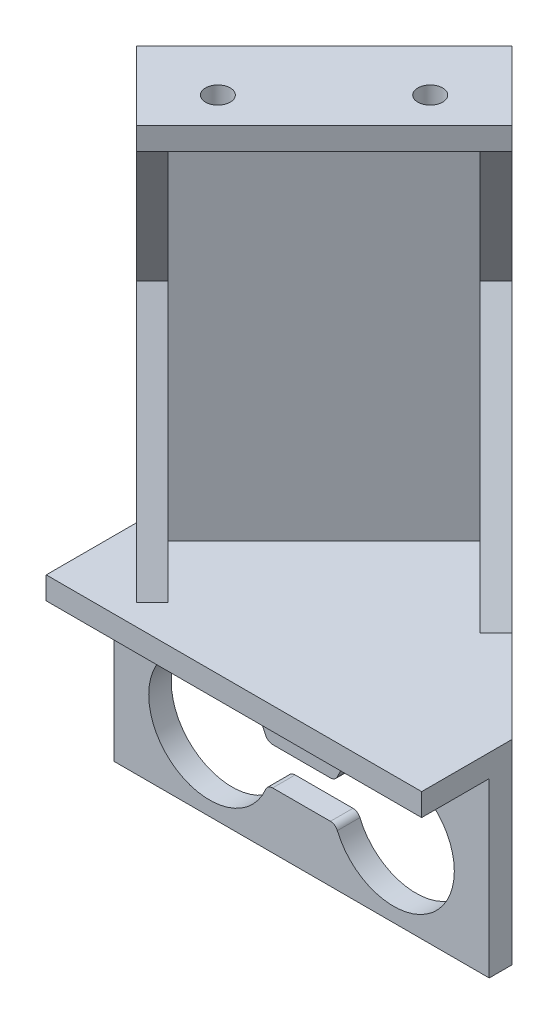
ISO-10303-21;
HEADER;
FILE_DESCRIPTION(('STEP AP214'),'2;1');
FILE_NAME('part.step','',(''),(''),'','','');
FILE_SCHEMA(('AUTOMOTIVE_DESIGN { 1 0 10303 214 1 1 1 1 }'));
ENDSEC;
DATA;
#1=APPLICATION_CONTEXT('core data for automotive mechanical design processes');
#2=APPLICATION_PROTOCOL_DEFINITION('international standard','automotive_design',2000,#1);
#3=PRODUCT_CONTEXT('',#1,'mechanical');
#4=PRODUCT('Part','Part','',(#3));
#5=PRODUCT_RELATED_PRODUCT_CATEGORY('part','',(#4));
#6=PRODUCT_DEFINITION_FORMATION('','',#4);
#7=PRODUCT_DEFINITION_CONTEXT('part definition',#1,'design');
#8=PRODUCT_DEFINITION('design','',#6,#7);
#9=PRODUCT_DEFINITION_SHAPE('','',#8);
#10=(LENGTH_UNIT() NAMED_UNIT(*) SI_UNIT(.MILLI.,.METRE.));
#11=(NAMED_UNIT(*) PLANE_ANGLE_UNIT() SI_UNIT($,.RADIAN.));
#12=(NAMED_UNIT(*) SI_UNIT($,.STERADIAN.) SOLID_ANGLE_UNIT());
#13=UNCERTAINTY_MEASURE_WITH_UNIT(LENGTH_MEASURE(1.E-05),#10,'distance_accuracy_value','');
#14=(GEOMETRIC_REPRESENTATION_CONTEXT(3) GLOBAL_UNCERTAINTY_ASSIGNED_CONTEXT((#13)) GLOBAL_UNIT_ASSIGNED_CONTEXT((#10,
#11,#12)) REPRESENTATION_CONTEXT('',''));
#15=CARTESIAN_POINT('',(0.,0.,0.));
#16=DIRECTION('',(0.,0.,1.));
#17=DIRECTION('',(1.,0.,0.));
#18=AXIS2_PLACEMENT_3D('',#15,#16,#17);
#19=CARTESIAN_POINT('',(2.12132034355976,71.,-22.8786796564402));
#20=DIRECTION('',(0.707106781186548,0.,0.707106781186547));
#21=DIRECTION('',(0.707106781186547,0.,-0.707106781186548));
#22=AXIS2_PLACEMENT_3D('',#19,#20,#21);
#23=PLANE('',#22);
#24=DIRECTION('',(0.707106781186547,0.,-0.707106781186548));
#25=VECTOR('',#24,1.);
#26=CARTESIAN_POINT('',(1.23165366794353E-13,68.,-20.7573593128806));
#27=LINE('',#26,#25);
#28=CARTESIAN_POINT('',(-20.7573593128806,68.,1.30537941567255E-13));
#29=VERTEX_POINT('',#28);
#30=CARTESIAN_POINT('',(1.22506171873482E-13,68.,-20.7573593128806));
#31=VERTEX_POINT('',#30);
#32=EDGE_CURVE('E301',#29,#31,#27,.T.);
#33=ORIENTED_EDGE('',*,*,#32,.F.);
#34=DIRECTION('',(0.,1.,0.));
#35=VECTOR('',#34,1.);
#36=CARTESIAN_POINT('',(-20.7573593128806,0.,1.22731685925359E-13));
#37=LINE('',#36,#35);
#38=CARTESIAN_POINT('',(-20.7573593128806,46.,1.24032728532342E-13));
#39=VERTEX_POINT('',#38);
#40=EDGE_CURVE('E572',#39,#29,#37,.T.);
#41=ORIENTED_EDGE('',*,*,#40,.F.);
#42=DIRECTION('',(0.,1.,0.));
#43=VECTOR('',#42,1.);
#44=CARTESIAN_POINT('',(-20.7573593128806,0.,1.22731685925359E-13));
#45=LINE('',#44,#43);
#46=CARTESIAN_POINT('',(-20.7573593128806,16.,1.27502175484295E-13));
#47=VERTEX_POINT('',#46);
#48=EDGE_CURVE('E562',#47,#39,#45,.T.);
#49=ORIENTED_EDGE('',*,*,#48,.F.);
#50=DIRECTION('',(-0.707106781186547,0.,0.707106781186548));
#51=VECTOR('',#50,1.);
#52=CARTESIAN_POINT('',(2.12132034355977,16.,-22.8786796564402));
#53=LINE('',#52,#51);
#54=CARTESIAN_POINT('',(0.,16.,-20.7573593128805));
#55=VERTEX_POINT('',#54);
#56=EDGE_CURVE('E309',#55,#47,#53,.T.);
#57=ORIENTED_EDGE('',*,*,#56,.F.);
#58=DIRECTION('',(0.,-1.,0.));
#59=VECTOR('',#58,1.);
#60=CARTESIAN_POINT('',(0.,0.,-20.7573593128805));
#61=LINE('',#60,#59);
#62=CARTESIAN_POINT('',(0.,46.,-20.7573593128805));
#63=VERTEX_POINT('',#62);
#64=EDGE_CURVE('E520',#63,#55,#61,.T.);
#65=ORIENTED_EDGE('',*,*,#64,.F.);
#66=DIRECTION('',(0.,-1.,0.));
#67=VECTOR('',#66,1.);
#68=CARTESIAN_POINT('',(0.,0.,-20.7573593128805));
#69=LINE('',#68,#67);
#70=EDGE_CURVE('E518',#31,#63,#69,.T.);
#71=ORIENTED_EDGE('',*,*,#70,.F.);
#72=EDGE_LOOP('',(#33,#41,#49,#57,#65,#71));
#73=FACE_BOUND('',#72,.T.);
#74=ADVANCED_FACE('F78',(#73),#23,.T.);
#75=CARTESIAN_POINT('',(7.0710678118656,68.,-13.6862915010151));
#76=DIRECTION('',(0.,1.,0.));
#77=DIRECTION('',(-1.,0.,0.));
#78=AXIS2_PLACEMENT_3D('',#75,#76,#77);
#79=PLANE('',#78);
#80=CARTESIAN_POINT('',(0.227922061357971,68.,-13.914213562373));
#81=DIRECTION('',(0.,-1.,0.));
#82=DIRECTION('',(0.,0.,-1.));
#83=AXIS2_PLACEMENT_3D('',#80,#81,#82);
#84=CIRCLE('',#83,1.65);
#85=CARTESIAN_POINT('',(0.227922061357971,68.,-15.564213562373));
#86=VERTEX_POINT('',#85);
#87=EDGE_CURVE('E591',#86,#86,#84,.T.);
#88=ORIENTED_EDGE('',*,*,#87,.F.);
#89=EDGE_LOOP('',(#88));
#90=FACE_BOUND('',#89,.T.);
#91=CARTESIAN_POINT('',(-13.914213562373,68.,0.227922061357981));
#92=DIRECTION('',(0.,-1.,0.));
#93=DIRECTION('',(0.,0.,-1.));
#94=AXIS2_PLACEMENT_3D('',#91,#92,#93);
#95=CIRCLE('',#94,1.65);
#96=CARTESIAN_POINT('',(-13.914213562373,68.,-1.42207793864202));
#97=VERTEX_POINT('',#96);
#98=EDGE_CURVE('E585',#97,#97,#95,.T.);
#99=ORIENTED_EDGE('',*,*,#98,.F.);
#100=EDGE_LOOP('',(#99));
#101=FACE_BOUND('',#100,.T.);
#102=DIRECTION('',(0.707106781186549,0.,0.707106781186547));
#103=VECTOR('',#102,1.);
#104=CARTESIAN_POINT('',(-10.3786796564403,68.,10.3786796564404));
#105=LINE('',#104,#103);
#106=CARTESIAN_POINT('',(-13.6862915010151,68.,7.0710678118656));
#107=VERTEX_POINT('',#106);
#108=EDGE_CURVE('E294',#29,#107,#105,.T.);
#109=ORIENTED_EDGE('',*,*,#108,.F.);
#110=ORIENTED_EDGE('',*,*,#32,.T.);
#111=DIRECTION('',(-0.707106781186548,0.,-0.707106781186547));
#112=VECTOR('',#111,1.);
#113=CARTESIAN_POINT('',(7.0710678118656,68.,-13.6862915010151));
#114=LINE('',#113,#112);
#115=CARTESIAN_POINT('',(7.0710678118656,68.,-13.6862915010151));
#116=VERTEX_POINT('',#115);
#117=EDGE_CURVE('E284',#116,#31,#114,.T.);
#118=ORIENTED_EDGE('',*,*,#117,.F.);
#119=DIRECTION('',(0.707106781186547,0.,-0.707106781186548));
#120=VECTOR('',#119,1.);
#121=CARTESIAN_POINT('',(7.0710678118656,68.,-13.6862915010151));
#122=LINE('',#121,#120);
#123=EDGE_CURVE('E285',#107,#116,#122,.T.);
#124=ORIENTED_EDGE('',*,*,#123,.F.);
#125=EDGE_LOOP('',(#109,#110,#118,#124));
#126=FACE_BOUND('',#125,.T.);
#127=ADVANCED_FACE('F606',(#90,#101,#126),#79,.F.);
#128=CARTESIAN_POINT('',(0.,16.,0.));
#129=DIRECTION('',(0.,1.,0.));
#130=DIRECTION('',(-1.,0.,0.));
#131=AXIS2_PLACEMENT_3D('',#128,#129,#130);
#132=PLANE('',#131);
#133=ORIENTED_EDGE('',*,*,#56,.T.);
#134=DIRECTION('',(0.707106781186549,0.,0.707106781186547));
#135=VECTOR('',#134,1.);
#136=CARTESIAN_POINT('',(-10.3786796564403,16.,10.3786796564404));
#137=LINE('',#136,#135);
#138=CARTESIAN_POINT('',(-13.6862915010151,16.,7.0710678118656));
#139=VERTEX_POINT('',#138);
#140=EDGE_CURVE('E93',#47,#139,#137,.T.);
#141=ORIENTED_EDGE('',*,*,#140,.T.);
#142=DIRECTION('',(-0.707106781186546,0.,0.707106781186548));
#143=VECTOR('',#142,1.);
#144=CARTESIAN_POINT('',(-13.6862915010151,16.,7.07106781186559));
#145=LINE('',#144,#143);
#146=CARTESIAN_POINT('',(-15.8076118445747,16.,9.19238815542524));
#147=VERTEX_POINT('',#146);
#148=EDGE_CURVE('E575',#139,#147,#145,.T.);
#149=ORIENTED_EDGE('',*,*,#148,.T.);
#150=DIRECTION('',(0.707106781186549,0.,0.707106781186546));
#151=VECTOR('',#150,1.);
#152=CARTESIAN_POINT('',(-25.,16.,0.));
#153=LINE('',#152,#151);
#154=CARTESIAN_POINT('',(-25.,16.,0.));
#155=VERTEX_POINT('',#154);
#156=EDGE_CURVE('E101',#155,#147,#153,.T.);
#157=ORIENTED_EDGE('',*,*,#156,.F.);
#158=DIRECTION('',(0.,0.,1.));
#159=VECTOR('',#158,1.);
#160=CARTESIAN_POINT('',(-25.,16.,0.));
#161=LINE('',#160,#159);
#162=CARTESIAN_POINT('',(-25.,16.,12.));
#163=VERTEX_POINT('',#162);
#164=EDGE_CURVE('E346',#155,#163,#161,.T.);
#165=ORIENTED_EDGE('',*,*,#164,.T.);
#166=DIRECTION('',(1.,0.,0.));
#167=VECTOR('',#166,1.);
#168=CARTESIAN_POINT('',(-25.,16.,12.));
#169=LINE('',#168,#167);
#170=CARTESIAN_POINT('',(25.,16.,12.));
#171=VERTEX_POINT('',#170);
#172=EDGE_CURVE('E349',#163,#171,#169,.T.);
#173=ORIENTED_EDGE('',*,*,#172,.T.);
#174=DIRECTION('',(0.,0.,-1.));
#175=VECTOR('',#174,1.);
#176=CARTESIAN_POINT('',(25.,16.,0.));
#177=LINE('',#176,#175);
#178=CARTESIAN_POINT('',(25.,16.,0.));
#179=VERTEX_POINT('',#178);
#180=EDGE_CURVE('E351',#171,#179,#177,.T.);
#181=ORIENTED_EDGE('',*,*,#180,.T.);
#182=DIRECTION('',(-0.707106781186551,0.,-0.707106781186544));
#183=VECTOR('',#182,1.);
#184=CARTESIAN_POINT('',(25.,16.,0.));
#185=LINE('',#184,#183);
#186=CARTESIAN_POINT('',(12.7279220613579,16.,-12.272077938642));
#187=VERTEX_POINT('',#186);
#188=EDGE_CURVE('E320',#179,#187,#185,.T.);
#189=ORIENTED_EDGE('',*,*,#188,.T.);
#190=DIRECTION('',(0.707106781186544,0.,-0.707106781186551));
#191=VECTOR('',#190,1.);
#192=CARTESIAN_POINT('',(10.6066017177983,16.,-10.1507575950823));
#193=LINE('',#192,#191);
#194=CARTESIAN_POINT('',(10.6066017177983,16.,-10.1507575950823));
#195=VERTEX_POINT('',#194);
#196=EDGE_CURVE('E306',#195,#187,#193,.T.);
#197=ORIENTED_EDGE('',*,*,#196,.F.);
#198=DIRECTION('',(0.707106781186551,0.,0.707106781186544));
#199=VECTOR('',#198,1.);
#200=CARTESIAN_POINT('',(10.3786796564402,16.,-10.3786796564403));
#201=LINE('',#200,#199);
#202=EDGE_CURVE('E538',#55,#195,#201,.T.);
#203=ORIENTED_EDGE('',*,*,#202,.F.);
#204=EDGE_LOOP('',(#133,#141,#149,#157,#165,#173,#181,#189,#197,#203));
#205=FACE_BOUND('',#204,.T.);
#206=ADVANCED_FACE('F493',(#205),#132,.T.);
#207=CARTESIAN_POINT('',(-25.,16.,12.));
#208=DIRECTION('',(0.,0.,-1.));
#209=DIRECTION('',(-1.,0.,0.));
#210=AXIS2_PLACEMENT_3D('',#207,#208,#209);
#211=PLANE('',#210);
#212=DIRECTION('',(-1.,0.,0.));
#213=VECTOR('',#212,1.);
#214=CARTESIAN_POINT('',(25.,13.,12.));
#215=LINE('',#214,#213);
#216=CARTESIAN_POINT('',(25.,13.,12.));
#217=VERTEX_POINT('',#216);
#218=CARTESIAN_POINT('',(-25.,13.,12.));
#219=VERTEX_POINT('',#218);
#220=EDGE_CURVE('E338',#217,#219,#215,.T.);
#221=ORIENTED_EDGE('',*,*,#220,.F.);
#222=DIRECTION('',(0.,-1.,0.));
#223=VECTOR('',#222,1.);
#224=CARTESIAN_POINT('',(25.,16.,12.));
#225=LINE('',#224,#223);
#226=EDGE_CURVE('E354',#171,#217,#225,.T.);
#227=ORIENTED_EDGE('',*,*,#226,.F.);
#228=ORIENTED_EDGE('',*,*,#172,.F.);
#229=DIRECTION('',(0.,-1.,0.));
#230=VECTOR('',#229,1.);
#231=CARTESIAN_POINT('',(-25.,16.,12.));
#232=LINE('',#231,#230);
#233=EDGE_CURVE('E357',#163,#219,#232,.T.);
#234=ORIENTED_EDGE('',*,*,#233,.T.);
#235=EDGE_LOOP('',(#221,#227,#228,#234));
#236=FACE_BOUND('',#235,.T.);
#237=ADVANCED_FACE('F499',(#236),#211,.F.);
#238=CARTESIAN_POINT('',(0.,0.,3.));
#239=DIRECTION('',(0.,0.,1.));
#240=DIRECTION('',(1.,0.,0.));
#241=AXIS2_PLACEMENT_3D('',#238,#239,#240);
#242=PLANE('',#241);
#243=DIRECTION('',(0.,-1.,0.));
#244=VECTOR('',#243,1.);
#245=CARTESIAN_POINT('',(-25.,-10.,3.));
#246=LINE('',#245,#244);
#247=CARTESIAN_POINT('',(-25.,13.,3.));
#248=VERTEX_POINT('',#247);
#249=CARTESIAN_POINT('',(-25.,-10.,3.));
#250=VERTEX_POINT('',#249);
#251=EDGE_CURVE('E451',#248,#250,#246,.T.);
#252=ORIENTED_EDGE('',*,*,#251,.T.);
#253=DIRECTION('',(1.,0.,0.));
#254=VECTOR('',#253,1.);
#255=CARTESIAN_POINT('',(25.,-10.,3.));
#256=LINE('',#255,#254);
#257=CARTESIAN_POINT('',(25.,-10.,3.));
#258=VERTEX_POINT('',#257);
#259=EDGE_CURVE('E454',#250,#258,#256,.T.);
#260=ORIENTED_EDGE('',*,*,#259,.T.);
#261=DIRECTION('',(0.,1.,0.));
#262=VECTOR('',#261,1.);
#263=CARTESIAN_POINT('',(25.,-10.,3.));
#264=LINE('',#263,#262);
#265=CARTESIAN_POINT('',(25.,13.,3.));
#266=VERTEX_POINT('',#265);
#267=EDGE_CURVE('E457',#258,#266,#264,.T.);
#268=ORIENTED_EDGE('',*,*,#267,.T.);
#269=DIRECTION('',(1.,0.,0.));
#270=VECTOR('',#269,1.);
#271=CARTESIAN_POINT('',(25.,13.,3.));
#272=LINE('',#271,#270);
#273=EDGE_CURVE('E343',#248,#266,#272,.T.);
#274=ORIENTED_EDGE('',*,*,#273,.F.);
#275=EDGE_LOOP('',(#252,#260,#268,#274));
#276=FACE_BOUND('',#275,.T.);
#277=CARTESIAN_POINT('',(12.25,0.,3.));
#278=DIRECTION('',(0.,0.,1.));
#279=DIRECTION('',(1.,0.,0.));
#280=AXIS2_PLACEMENT_3D('',#277,#278,#279);
#281=CIRCLE('',#280,8.1);
#282=CARTESIAN_POINT('',(4.77307692307692,-3.11538461538461,3.));
#283=VERTEX_POINT('',#282);
#284=CARTESIAN_POINT('',(4.77307692307692,3.11538461538462,3.));
#285=VERTEX_POINT('',#284);
#286=EDGE_CURVE('E394',#283,#285,#281,.T.);
#287=ORIENTED_EDGE('',*,*,#286,.F.);
#288=CARTESIAN_POINT('',(3.85,-3.5,3.));
#289=DIRECTION('',(0.,0.,-1.));
#290=DIRECTION('',(-1.,0.,0.));
#291=AXIS2_PLACEMENT_3D('',#288,#289,#290);
#292=CIRCLE('',#291,1.);
#293=CARTESIAN_POINT('',(3.85,-2.5,3.));
#294=VERTEX_POINT('',#293);
#295=EDGE_CURVE('E392',#294,#283,#292,.T.);
#296=ORIENTED_EDGE('',*,*,#295,.F.);
#297=DIRECTION('',(1.,0.,0.));
#298=VECTOR('',#297,1.);
#299=CARTESIAN_POINT('',(3.85,-2.5,3.));
#300=LINE('',#299,#298);
#301=CARTESIAN_POINT('',(-3.85,-2.5,3.));
#302=VERTEX_POINT('',#301);
#303=EDGE_CURVE('E408',#302,#294,#300,.T.);
#304=ORIENTED_EDGE('',*,*,#303,.F.);
#305=CARTESIAN_POINT('',(-3.85,-3.5,3.));
#306=DIRECTION('',(0.,0.,-1.));
#307=DIRECTION('',(1.,0.,0.));
#308=AXIS2_PLACEMENT_3D('',#305,#306,#307);
#309=CIRCLE('',#308,1.);
#310=CARTESIAN_POINT('',(-4.77307692307692,-3.11538461538462,3.));
#311=VERTEX_POINT('',#310);
#312=EDGE_CURVE('E405',#311,#302,#309,.T.);
#313=ORIENTED_EDGE('',*,*,#312,.F.);
#314=CARTESIAN_POINT('',(-12.25,0.,3.));
#315=DIRECTION('',(0.,0.,1.));
#316=DIRECTION('',(1.,0.,0.));
#317=AXIS2_PLACEMENT_3D('',#314,#315,#316);
#318=CIRCLE('',#317,8.1);
#319=CARTESIAN_POINT('',(-4.77307692307692,3.11538461538461,3.));
#320=VERTEX_POINT('',#319);
#321=EDGE_CURVE('E403',#320,#311,#318,.T.);
#322=ORIENTED_EDGE('',*,*,#321,.F.);
#323=CARTESIAN_POINT('',(-3.85,3.5,3.));
#324=DIRECTION('',(0.,0.,-1.));
#325=DIRECTION('',(-1.,0.,0.));
#326=AXIS2_PLACEMENT_3D('',#323,#324,#325);
#327=CIRCLE('',#326,1.);
#328=CARTESIAN_POINT('',(-3.85,2.5,3.));
#329=VERTEX_POINT('',#328);
#330=EDGE_CURVE('E401',#329,#320,#327,.T.);
#331=ORIENTED_EDGE('',*,*,#330,.F.);
#332=DIRECTION('',(-1.,0.,0.));
#333=VECTOR('',#332,1.);
#334=CARTESIAN_POINT('',(-3.85,2.5,3.));
#335=LINE('',#334,#333);
#336=CARTESIAN_POINT('',(3.85,2.5,3.));
#337=VERTEX_POINT('',#336);
#338=EDGE_CURVE('E399',#337,#329,#335,.T.);
#339=ORIENTED_EDGE('',*,*,#338,.F.);
#340=CARTESIAN_POINT('',(3.85,3.5,3.));
#341=DIRECTION('',(0.,0.,-1.));
#342=DIRECTION('',(1.,0.,0.));
#343=AXIS2_PLACEMENT_3D('',#340,#341,#342);
#344=CIRCLE('',#343,1.);
#345=EDGE_CURVE('E397',#285,#337,#344,.T.);
#346=ORIENTED_EDGE('',*,*,#345,.F.);
#347=EDGE_LOOP('',(#287,#296,#304,#313,#322,#331,#339,#346));
#348=FACE_BOUND('',#347,.T.);
#349=DIRECTION('',(-1.,0.,0.));
#350=VECTOR('',#349,1.);
#351=CARTESIAN_POINT('',(3.25,9.,3.));
#352=LINE('',#351,#350);
#353=CARTESIAN_POINT('',(3.25,9.,3.));
#354=VERTEX_POINT('',#353);
#355=CARTESIAN_POINT('',(-3.25,9.,3.));
#356=VERTEX_POINT('',#355);
#357=EDGE_CURVE('E363',#354,#356,#352,.T.);
#358=ORIENTED_EDGE('',*,*,#357,.F.);
#359=CARTESIAN_POINT('',(3.25,7.25,3.));
#360=DIRECTION('',(0.,0.,1.));
#361=DIRECTION('',(1.,0.,0.));
#362=AXIS2_PLACEMENT_3D('',#359,#360,#361);
#363=CIRCLE('',#362,1.75);
#364=CARTESIAN_POINT('',(3.25,5.5,3.));
#365=VERTEX_POINT('',#364);
#366=EDGE_CURVE('E361',#365,#354,#363,.T.);
#367=ORIENTED_EDGE('',*,*,#366,.F.);
#368=DIRECTION('',(1.,0.,0.));
#369=VECTOR('',#368,1.);
#370=CARTESIAN_POINT('',(3.25,5.5,3.));
#371=LINE('',#370,#369);
#372=CARTESIAN_POINT('',(-3.25,5.5,3.));
#373=VERTEX_POINT('',#372);
#374=EDGE_CURVE('E369',#373,#365,#371,.T.);
#375=ORIENTED_EDGE('',*,*,#374,.F.);
#376=CARTESIAN_POINT('',(-3.25,7.25,3.));
#377=DIRECTION('',(0.,0.,1.));
#378=DIRECTION('',(1.,0.,0.));
#379=AXIS2_PLACEMENT_3D('',#376,#377,#378);
#380=CIRCLE('',#379,1.75);
#381=EDGE_CURVE('E366',#356,#373,#380,.T.);
#382=ORIENTED_EDGE('',*,*,#381,.F.);
#383=EDGE_LOOP('',(#358,#367,#375,#382));
#384=FACE_BOUND('',#383,.T.);
#385=ADVANCED_FACE('F505',(#276,#348,#384),#242,.T.);
#386=CARTESIAN_POINT('',(0.,0.,0.));
#387=DIRECTION('',(0.,0.,1.));
#388=DIRECTION('',(1.,0.,0.));
#389=AXIS2_PLACEMENT_3D('',#386,#387,#388);
#390=PLANE('',#389);
#391=CARTESIAN_POINT('',(3.85,-3.5,0.));
#392=DIRECTION('',(0.,0.,-1.));
#393=DIRECTION('',(-1.,0.,0.));
#394=AXIS2_PLACEMENT_3D('',#391,#392,#393);
#395=CIRCLE('',#394,1.);
#396=CARTESIAN_POINT('',(3.85,-2.5,0.));
#397=VERTEX_POINT('',#396);
#398=CARTESIAN_POINT('',(4.77307692307692,-3.11538461538461,0.));
#399=VERTEX_POINT('',#398);
#400=EDGE_CURVE('E391',#397,#399,#395,.T.);
#401=ORIENTED_EDGE('',*,*,#400,.T.);
#402=CARTESIAN_POINT('',(12.25,0.,0.));
#403=DIRECTION('',(0.,0.,1.));
#404=DIRECTION('',(1.,0.,0.));
#405=AXIS2_PLACEMENT_3D('',#402,#403,#404);
#406=CIRCLE('',#405,8.1);
#407=CARTESIAN_POINT('',(4.77307692307692,3.11538461538462,0.));
#408=VERTEX_POINT('',#407);
#409=EDGE_CURVE('E413',#399,#408,#406,.T.);
#410=ORIENTED_EDGE('',*,*,#409,.T.);
#411=CARTESIAN_POINT('',(3.85,3.5,0.));
#412=DIRECTION('',(0.,0.,-1.));
#413=DIRECTION('',(1.,0.,0.));
#414=AXIS2_PLACEMENT_3D('',#411,#412,#413);
#415=CIRCLE('',#414,1.);
#416=CARTESIAN_POINT('',(3.85,2.5,0.));
#417=VERTEX_POINT('',#416);
#418=EDGE_CURVE('E416',#408,#417,#415,.T.);
#419=ORIENTED_EDGE('',*,*,#418,.T.);
#420=DIRECTION('',(-1.,0.,0.));
#421=VECTOR('',#420,1.);
#422=CARTESIAN_POINT('',(-3.85,2.5,0.));
#423=LINE('',#422,#421);
#424=CARTESIAN_POINT('',(-3.85,2.5,0.));
#425=VERTEX_POINT('',#424);
#426=EDGE_CURVE('E419',#417,#425,#423,.T.);
#427=ORIENTED_EDGE('',*,*,#426,.T.);
#428=CARTESIAN_POINT('',(-3.85,3.5,0.));
#429=DIRECTION('',(0.,0.,-1.));
#430=DIRECTION('',(-1.,0.,0.));
#431=AXIS2_PLACEMENT_3D('',#428,#429,#430);
#432=CIRCLE('',#431,1.);
#433=CARTESIAN_POINT('',(-4.77307692307692,3.11538461538461,0.));
#434=VERTEX_POINT('',#433);
#435=EDGE_CURVE('E422',#425,#434,#432,.T.);
#436=ORIENTED_EDGE('',*,*,#435,.T.);
#437=CARTESIAN_POINT('',(-12.25,0.,0.));
#438=DIRECTION('',(0.,0.,1.));
#439=DIRECTION('',(1.,0.,0.));
#440=AXIS2_PLACEMENT_3D('',#437,#438,#439);
#441=CIRCLE('',#440,8.1);
#442=CARTESIAN_POINT('',(-4.77307692307692,-3.11538461538462,0.));
#443=VERTEX_POINT('',#442);
#444=EDGE_CURVE('E425',#434,#443,#441,.T.);
#445=ORIENTED_EDGE('',*,*,#444,.T.);
#446=CARTESIAN_POINT('',(-3.85,-3.5,0.));
#447=DIRECTION('',(0.,0.,-1.));
#448=DIRECTION('',(1.,0.,0.));
#449=AXIS2_PLACEMENT_3D('',#446,#447,#448);
#450=CIRCLE('',#449,1.);
#451=CARTESIAN_POINT('',(-3.85,-2.5,0.));
#452=VERTEX_POINT('',#451);
#453=EDGE_CURVE('E428',#443,#452,#450,.T.);
#454=ORIENTED_EDGE('',*,*,#453,.T.);
#455=DIRECTION('',(1.,0.,0.));
#456=VECTOR('',#455,1.);
#457=CARTESIAN_POINT('',(3.85,-2.5,0.));
#458=LINE('',#457,#456);
#459=EDGE_CURVE('E395',#452,#397,#458,.T.);
#460=ORIENTED_EDGE('',*,*,#459,.T.);
#461=EDGE_LOOP('',(#401,#410,#419,#427,#436,#445,#454,#460));
#462=FACE_BOUND('',#461,.T.);
#463=DIRECTION('',(0.,-1.,0.));
#464=VECTOR('',#463,1.);
#465=CARTESIAN_POINT('',(-25.,-10.,0.));
#466=LINE('',#465,#464);
#467=CARTESIAN_POINT('',(-25.,13.,0.));
#468=VERTEX_POINT('',#467);
#469=CARTESIAN_POINT('',(-25.,-10.,0.));
#470=VERTEX_POINT('',#469);
#471=EDGE_CURVE('E450',#468,#470,#466,.T.);
#472=ORIENTED_EDGE('',*,*,#471,.F.);
#473=DIRECTION('',(1.,0.,0.));
#474=VECTOR('',#473,1.);
#475=CARTESIAN_POINT('',(25.,13.,0.));
#476=LINE('',#475,#474);
#477=CARTESIAN_POINT('',(25.,13.,0.));
#478=VERTEX_POINT('',#477);
#479=EDGE_CURVE('E321',#468,#478,#476,.T.);
#480=ORIENTED_EDGE('',*,*,#479,.T.);
#481=DIRECTION('',(0.,1.,0.));
#482=VECTOR('',#481,1.);
#483=CARTESIAN_POINT('',(25.,-10.,0.));
#484=LINE('',#483,#482);
#485=CARTESIAN_POINT('',(25.,-10.,0.));
#486=VERTEX_POINT('',#485);
#487=EDGE_CURVE('E455',#486,#478,#484,.T.);
#488=ORIENTED_EDGE('',*,*,#487,.F.);
#489=DIRECTION('',(1.,0.,0.));
#490=VECTOR('',#489,1.);
#491=CARTESIAN_POINT('',(25.,-10.,0.));
#492=LINE('',#491,#490);
#493=EDGE_CURVE('E462',#470,#486,#492,.T.);
#494=ORIENTED_EDGE('',*,*,#493,.F.);
#495=EDGE_LOOP('',(#472,#480,#488,#494));
#496=FACE_BOUND('',#495,.T.);
#497=CARTESIAN_POINT('',(3.25,7.25,0.));
#498=DIRECTION('',(0.,0.,1.));
#499=DIRECTION('',(1.,0.,0.));
#500=AXIS2_PLACEMENT_3D('',#497,#498,#499);
#501=CIRCLE('',#500,1.75);
#502=CARTESIAN_POINT('',(3.25,5.5,0.));
#503=VERTEX_POINT('',#502);
#504=CARTESIAN_POINT('',(3.25,9.,0.));
#505=VERTEX_POINT('',#504);
#506=EDGE_CURVE('E360',#503,#505,#501,.T.);
#507=ORIENTED_EDGE('',*,*,#506,.T.);
#508=DIRECTION('',(-1.,0.,0.));
#509=VECTOR('',#508,1.);
#510=CARTESIAN_POINT('',(3.25,9.,0.));
#511=LINE('',#510,#509);
#512=CARTESIAN_POINT('',(-3.25,9.,0.));
#513=VERTEX_POINT('',#512);
#514=EDGE_CURVE('E374',#505,#513,#511,.T.);
#515=ORIENTED_EDGE('',*,*,#514,.T.);
#516=CARTESIAN_POINT('',(-3.25,7.25,0.));
#517=DIRECTION('',(0.,0.,1.));
#518=DIRECTION('',(1.,0.,0.));
#519=AXIS2_PLACEMENT_3D('',#516,#517,#518);
#520=CIRCLE('',#519,1.75);
#521=CARTESIAN_POINT('',(-3.25,5.5,0.));
#522=VERTEX_POINT('',#521);
#523=EDGE_CURVE('E377',#513,#522,#520,.T.);
#524=ORIENTED_EDGE('',*,*,#523,.T.);
#525=DIRECTION('',(1.,0.,0.));
#526=VECTOR('',#525,1.);
#527=CARTESIAN_POINT('',(3.25,5.5,0.));
#528=LINE('',#527,#526);
#529=EDGE_CURVE('E364',#522,#503,#528,.T.);
#530=ORIENTED_EDGE('',*,*,#529,.T.);
#531=EDGE_LOOP('',(#507,#515,#524,#530));
#532=FACE_BOUND('',#531,.T.);
#533=ADVANCED_FACE('F476',(#462,#496,#532),#390,.F.);
#534=CARTESIAN_POINT('',(-25.,-10.,3.));
#535=DIRECTION('',(1.,0.,0.));
#536=DIRECTION('',(0.,0.,-1.));
#537=AXIS2_PLACEMENT_3D('',#534,#535,#536);
#538=PLANE('',#537);
#539=ORIENTED_EDGE('',*,*,#251,.F.);
#540=DIRECTION('',(0.,0.,-1.));
#541=VECTOR('',#540,1.);
#542=CARTESIAN_POINT('',(-25.,13.,3.));
#543=LINE('',#542,#541);
#544=EDGE_CURVE('E340',#219,#248,#543,.T.);
#545=ORIENTED_EDGE('',*,*,#544,.F.);
#546=ORIENTED_EDGE('',*,*,#233,.F.);
#547=ORIENTED_EDGE('',*,*,#164,.F.);
#548=EDGE_CURVE('E459',#155,#468,#466,.T.);
#549=ORIENTED_EDGE('',*,*,#548,.T.);
#550=ORIENTED_EDGE('',*,*,#471,.T.);
#551=DIRECTION('',(0.,0.,-1.));
#552=VECTOR('',#551,1.);
#553=CARTESIAN_POINT('',(-25.,-10.,3.));
#554=LINE('',#553,#552);
#555=EDGE_CURVE('E12',#250,#470,#554,.T.);
#556=ORIENTED_EDGE('',*,*,#555,.F.);
#557=EDGE_LOOP('',(#539,#545,#546,#547,#549,#550,#556));
#558=FACE_BOUND('',#557,.T.);
#559=ADVANCED_FACE('F80',(#558),#538,.F.);
#560=CARTESIAN_POINT('',(25.,-10.,3.));
#561=DIRECTION('',(0.,1.,0.));
#562=DIRECTION('',(-1.,0.,0.));
#563=AXIS2_PLACEMENT_3D('',#560,#561,#562);
#564=PLANE('',#563);
#565=ORIENTED_EDGE('',*,*,#493,.T.);
#566=DIRECTION('',(0.,0.,-1.));
#567=VECTOR('',#566,1.);
#568=CARTESIAN_POINT('',(25.,-10.,3.));
#569=LINE('',#568,#567);
#570=EDGE_CURVE('E86',#258,#486,#569,.T.);
#571=ORIENTED_EDGE('',*,*,#570,.F.);
#572=ORIENTED_EDGE('',*,*,#259,.F.);
#573=ORIENTED_EDGE('',*,*,#555,.T.);
#574=EDGE_LOOP('',(#565,#571,#572,#573));
#575=FACE_BOUND('',#574,.T.);
#576=ADVANCED_FACE('F508',(#575),#564,.F.);
#577=CARTESIAN_POINT('',(25.,-10.,3.));
#578=DIRECTION('',(-1.,0.,0.));
#579=DIRECTION('',(0.,0.,1.));
#580=AXIS2_PLACEMENT_3D('',#577,#578,#579);
#581=PLANE('',#580);
#582=DIRECTION('',(0.,0.,1.));
#583=VECTOR('',#582,1.);
#584=CARTESIAN_POINT('',(25.,13.,3.));
#585=LINE('',#584,#583);
#586=EDGE_CURVE('E334',#266,#217,#585,.T.);
#587=ORIENTED_EDGE('',*,*,#586,.F.);
#588=ORIENTED_EDGE('',*,*,#267,.F.);
#589=ORIENTED_EDGE('',*,*,#570,.T.);
#590=ORIENTED_EDGE('',*,*,#487,.T.);
#591=DIRECTION('',(0.,1.,0.));
#592=VECTOR('',#591,1.);
#593=CARTESIAN_POINT('',(25.,13.,0.));
#594=LINE('',#593,#592);
#595=EDGE_CURVE('E330',#478,#179,#594,.T.);
#596=ORIENTED_EDGE('',*,*,#595,.T.);
#597=ORIENTED_EDGE('',*,*,#180,.F.);
#598=ORIENTED_EDGE('',*,*,#226,.T.);
#599=EDGE_LOOP('',(#587,#588,#589,#590,#596,#597,#598));
#600=FACE_BOUND('',#599,.T.);
#601=ADVANCED_FACE('F471',(#600),#581,.F.);
#602=CARTESIAN_POINT('',(3.85,-3.5,3.));
#603=DIRECTION('',(0.,0.,-1.));
#604=DIRECTION('',(-1.,0.,0.));
#605=AXIS2_PLACEMENT_3D('',#602,#603,#604);
#606=CYLINDRICAL_SURFACE('',#605,1.);
#607=ORIENTED_EDGE('',*,*,#400,.F.);
#608=DIRECTION('',(0.,0.,-1.));
#609=VECTOR('',#608,1.);
#610=CARTESIAN_POINT('',(3.85,-2.5,3.));
#611=LINE('',#610,#609);
#612=EDGE_CURVE('E410',#294,#397,#611,.T.);
#613=ORIENTED_EDGE('',*,*,#612,.F.);
#614=ORIENTED_EDGE('',*,*,#295,.T.);
#615=DIRECTION('',(0.,0.,-1.));
#616=VECTOR('',#615,1.);
#617=CARTESIAN_POINT('',(4.77307692307692,-3.11538461538461,3.));
#618=LINE('',#617,#616);
#619=EDGE_CURVE('E447',#283,#399,#618,.T.);
#620=ORIENTED_EDGE('',*,*,#619,.T.);
#621=EDGE_LOOP('',(#607,#613,#614,#620));
#622=FACE_BOUND('',#621,.T.);
#623=ADVANCED_FACE('F684',(#622),#606,.T.);
#624=CARTESIAN_POINT('',(12.25,0.,3.));
#625=DIRECTION('',(0.,0.,-1.));
#626=DIRECTION('',(-1.,0.,0.));
#627=AXIS2_PLACEMENT_3D('',#624,#625,#626);
#628=CYLINDRICAL_SURFACE('',#627,8.1);
#629=ORIENTED_EDGE('',*,*,#409,.F.);
#630=ORIENTED_EDGE('',*,*,#619,.F.);
#631=ORIENTED_EDGE('',*,*,#286,.T.);
#632=DIRECTION('',(0.,0.,-1.));
#633=VECTOR('',#632,1.);
#634=CARTESIAN_POINT('',(4.77307692307692,3.11538461538462,3.));
#635=LINE('',#634,#633);
#636=EDGE_CURVE('E445',#285,#408,#635,.T.);
#637=ORIENTED_EDGE('',*,*,#636,.T.);
#638=EDGE_LOOP('',(#629,#630,#631,#637));
#639=FACE_BOUND('',#638,.T.);
#640=ADVANCED_FACE('F680',(#639),#628,.F.);
#641=CARTESIAN_POINT('',(3.85,3.5,3.));
#642=DIRECTION('',(0.,0.,-1.));
#643=DIRECTION('',(-1.,0.,0.));
#644=AXIS2_PLACEMENT_3D('',#641,#642,#643);
#645=CYLINDRICAL_SURFACE('',#644,1.);
#646=ORIENTED_EDGE('',*,*,#418,.F.);
#647=ORIENTED_EDGE('',*,*,#636,.F.);
#648=ORIENTED_EDGE('',*,*,#345,.T.);
#649=DIRECTION('',(0.,0.,-1.));
#650=VECTOR('',#649,1.);
#651=CARTESIAN_POINT('',(3.85,2.5,3.));
#652=LINE('',#651,#650);
#653=EDGE_CURVE('E443',#337,#417,#652,.T.);
#654=ORIENTED_EDGE('',*,*,#653,.T.);
#655=EDGE_LOOP('',(#646,#647,#648,#654));
#656=FACE_BOUND('',#655,.T.);
#657=ADVANCED_FACE('F676',(#656),#645,.T.);
#658=CARTESIAN_POINT('',(-3.85,2.5,3.));
#659=DIRECTION('',(0.,-1.,0.));
#660=DIRECTION('',(0.,0.,-1.));
#661=AXIS2_PLACEMENT_3D('',#658,#659,#660);
#662=PLANE('',#661);
#663=ORIENTED_EDGE('',*,*,#426,.F.);
#664=ORIENTED_EDGE('',*,*,#653,.F.);
#665=ORIENTED_EDGE('',*,*,#338,.T.);
#666=DIRECTION('',(0.,0.,-1.));
#667=VECTOR('',#666,1.);
#668=CARTESIAN_POINT('',(-3.85,2.5,3.));
#669=LINE('',#668,#667);
#670=EDGE_CURVE('E441',#329,#425,#669,.T.);
#671=ORIENTED_EDGE('',*,*,#670,.T.);
#672=EDGE_LOOP('',(#663,#664,#665,#671));
#673=FACE_BOUND('',#672,.T.);
#674=ADVANCED_FACE('F672',(#673),#662,.T.);
#675=CARTESIAN_POINT('',(-3.85,3.5,3.));
#676=DIRECTION('',(0.,0.,-1.));
#677=DIRECTION('',(-1.,0.,0.));
#678=AXIS2_PLACEMENT_3D('',#675,#676,#677);
#679=CYLINDRICAL_SURFACE('',#678,1.);
#680=ORIENTED_EDGE('',*,*,#435,.F.);
#681=ORIENTED_EDGE('',*,*,#670,.F.);
#682=ORIENTED_EDGE('',*,*,#330,.T.);
#683=DIRECTION('',(0.,0.,-1.));
#684=VECTOR('',#683,1.);
#685=CARTESIAN_POINT('',(-4.77307692307692,3.11538461538461,3.));
#686=LINE('',#685,#684);
#687=EDGE_CURVE('E439',#320,#434,#686,.T.);
#688=ORIENTED_EDGE('',*,*,#687,.T.);
#689=EDGE_LOOP('',(#680,#681,#682,#688));
#690=FACE_BOUND('',#689,.T.);
#691=ADVANCED_FACE('F668',(#690),#679,.T.);
#692=CARTESIAN_POINT('',(-12.25,0.,3.));
#693=DIRECTION('',(0.,0.,-1.));
#694=DIRECTION('',(-1.,0.,0.));
#695=AXIS2_PLACEMENT_3D('',#692,#693,#694);
#696=CYLINDRICAL_SURFACE('',#695,8.1);
#697=ORIENTED_EDGE('',*,*,#444,.F.);
#698=ORIENTED_EDGE('',*,*,#687,.F.);
#699=ORIENTED_EDGE('',*,*,#321,.T.);
#700=DIRECTION('',(0.,0.,-1.));
#701=VECTOR('',#700,1.);
#702=CARTESIAN_POINT('',(-4.77307692307692,-3.11538461538462,3.));
#703=LINE('',#702,#701);
#704=EDGE_CURVE('E437',#311,#443,#703,.T.);
#705=ORIENTED_EDGE('',*,*,#704,.T.);
#706=EDGE_LOOP('',(#697,#698,#699,#705));
#707=FACE_BOUND('',#706,.T.);
#708=ADVANCED_FACE('F664',(#707),#696,.F.);
#709=CARTESIAN_POINT('',(-3.85,-3.5,3.));
#710=DIRECTION('',(0.,0.,-1.));
#711=DIRECTION('',(-1.,0.,0.));
#712=AXIS2_PLACEMENT_3D('',#709,#710,#711);
#713=CYLINDRICAL_SURFACE('',#712,1.);
#714=ORIENTED_EDGE('',*,*,#453,.F.);
#715=ORIENTED_EDGE('',*,*,#704,.F.);
#716=ORIENTED_EDGE('',*,*,#312,.T.);
#717=DIRECTION('',(0.,0.,-1.));
#718=VECTOR('',#717,1.);
#719=CARTESIAN_POINT('',(-3.85,-2.5,3.));
#720=LINE('',#719,#718);
#721=EDGE_CURVE('E435',#302,#452,#720,.T.);
#722=ORIENTED_EDGE('',*,*,#721,.T.);
#723=EDGE_LOOP('',(#714,#715,#716,#722));
#724=FACE_BOUND('',#723,.T.);
#725=ADVANCED_FACE('F660',(#724),#713,.T.);
#726=CARTESIAN_POINT('',(3.85,-2.5,3.));
#727=DIRECTION('',(0.,1.,0.));
#728=DIRECTION('',(-1.,0.,0.));
#729=AXIS2_PLACEMENT_3D('',#726,#727,#728);
#730=PLANE('',#729);
#731=ORIENTED_EDGE('',*,*,#459,.F.);
#732=ORIENTED_EDGE('',*,*,#721,.F.);
#733=ORIENTED_EDGE('',*,*,#303,.T.);
#734=ORIENTED_EDGE('',*,*,#612,.T.);
#735=EDGE_LOOP('',(#731,#732,#733,#734));
#736=FACE_BOUND('',#735,.T.);
#737=ADVANCED_FACE('F656',(#736),#730,.T.);
#738=CARTESIAN_POINT('',(3.25,7.25,3.));
#739=DIRECTION('',(0.,0.,-1.));
#740=DIRECTION('',(-1.,0.,0.));
#741=AXIS2_PLACEMENT_3D('',#738,#739,#740);
#742=CYLINDRICAL_SURFACE('',#741,1.75);
#743=ORIENTED_EDGE('',*,*,#506,.F.);
#744=DIRECTION('',(0.,0.,-1.));
#745=VECTOR('',#744,1.);
#746=CARTESIAN_POINT('',(3.25,5.5,3.));
#747=LINE('',#746,#745);
#748=EDGE_CURVE('E371',#365,#503,#747,.T.);
#749=ORIENTED_EDGE('',*,*,#748,.F.);
#750=ORIENTED_EDGE('',*,*,#366,.T.);
#751=DIRECTION('',(0.,0.,-1.));
#752=VECTOR('',#751,1.);
#753=CARTESIAN_POINT('',(3.25,9.,3.));
#754=LINE('',#753,#752);
#755=EDGE_CURVE('E388',#354,#505,#754,.T.);
#756=ORIENTED_EDGE('',*,*,#755,.T.);
#757=EDGE_LOOP('',(#743,#749,#750,#756));
#758=FACE_BOUND('',#757,.T.);
#759=ADVANCED_FACE('F652',(#758),#742,.F.);
#760=CARTESIAN_POINT('',(3.25,9.,3.));
#761=DIRECTION('',(0.,-1.,0.));
#762=DIRECTION('',(1.,0.,0.));
#763=AXIS2_PLACEMENT_3D('',#760,#761,#762);
#764=PLANE('',#763);
#765=ORIENTED_EDGE('',*,*,#514,.F.);
#766=ORIENTED_EDGE('',*,*,#755,.F.);
#767=ORIENTED_EDGE('',*,*,#357,.T.);
#768=DIRECTION('',(0.,0.,-1.));
#769=VECTOR('',#768,1.);
#770=CARTESIAN_POINT('',(-3.25,9.,3.));
#771=LINE('',#770,#769);
#772=EDGE_CURVE('E386',#356,#513,#771,.T.);
#773=ORIENTED_EDGE('',*,*,#772,.T.);
#774=EDGE_LOOP('',(#765,#766,#767,#773));
#775=FACE_BOUND('',#774,.T.);
#776=ADVANCED_FACE('F648',(#775),#764,.T.);
#777=CARTESIAN_POINT('',(-3.25,7.25,3.));
#778=DIRECTION('',(0.,0.,-1.));
#779=DIRECTION('',(-1.,0.,0.));
#780=AXIS2_PLACEMENT_3D('',#777,#778,#779);
#781=CYLINDRICAL_SURFACE('',#780,1.75);
#782=ORIENTED_EDGE('',*,*,#523,.F.);
#783=ORIENTED_EDGE('',*,*,#772,.F.);
#784=ORIENTED_EDGE('',*,*,#381,.T.);
#785=DIRECTION('',(0.,0.,-1.));
#786=VECTOR('',#785,1.);
#787=CARTESIAN_POINT('',(-3.25,5.5,3.));
#788=LINE('',#787,#786);
#789=EDGE_CURVE('E384',#373,#522,#788,.T.);
#790=ORIENTED_EDGE('',*,*,#789,.T.);
#791=EDGE_LOOP('',(#782,#783,#784,#790));
#792=FACE_BOUND('',#791,.T.);
#793=ADVANCED_FACE('F644',(#792),#781,.F.);
#794=CARTESIAN_POINT('',(3.25,5.5,3.));
#795=DIRECTION('',(0.,1.,0.));
#796=DIRECTION('',(0.,0.,1.));
#797=AXIS2_PLACEMENT_3D('',#794,#795,#796);
#798=PLANE('',#797);
#799=ORIENTED_EDGE('',*,*,#529,.F.);
#800=ORIENTED_EDGE('',*,*,#789,.F.);
#801=ORIENTED_EDGE('',*,*,#374,.T.);
#802=ORIENTED_EDGE('',*,*,#748,.T.);
#803=EDGE_LOOP('',(#799,#800,#801,#802));
#804=FACE_BOUND('',#803,.T.);
#805=ADVANCED_FACE('F637',(#804),#798,.T.);
#806=CARTESIAN_POINT('',(0.,13.,0.));
#807=DIRECTION('',(0.,-1.,0.));
#808=DIRECTION('',(1.,0.,0.));
#809=AXIS2_PLACEMENT_3D('',#806,#807,#808);
#810=PLANE('',#809);
#811=ORIENTED_EDGE('',*,*,#586,.T.);
#812=ORIENTED_EDGE('',*,*,#220,.T.);
#813=ORIENTED_EDGE('',*,*,#544,.T.);
#814=ORIENTED_EDGE('',*,*,#273,.T.);
#815=EDGE_LOOP('',(#811,#812,#813,#814));
#816=FACE_BOUND('',#815,.T.);
#817=ADVANCED_FACE('F501',(#816),#810,.T.);
#818=CARTESIAN_POINT('',(0.,13.,-24.9999999999997));
#819=DIRECTION('',(-0.707106781186544,0.,-0.707106781186551));
#820=DIRECTION('',(-0.707106781186551,0.,0.707106781186544));
#821=AXIS2_PLACEMENT_3D('',#818,#819,#820);
#822=PLANE('',#821);
#823=ORIENTED_EDGE('',*,*,#548,.F.);
#824=DIRECTION('',(0.,-1.,0.));
#825=VECTOR('',#824,1.);
#826=CARTESIAN_POINT('',(-25.,71.,0.));
#827=LINE('',#826,#825);
#828=CARTESIAN_POINT('',(-25.,71.,0.));
#829=VERTEX_POINT('',#828);
#830=EDGE_CURVE('E316',#829,#155,#827,.T.);
#831=ORIENTED_EDGE('',*,*,#830,.F.);
#832=DIRECTION('',(-0.707106781186551,0.,0.707106781186544));
#833=VECTOR('',#832,1.);
#834=CARTESIAN_POINT('',(0.,71.,-24.9999999999997));
#835=LINE('',#834,#833);
#836=CARTESIAN_POINT('',(0.,71.,-24.9999999999997));
#837=VERTEX_POINT('',#836);
#838=EDGE_CURVE('E314',#837,#829,#835,.T.);
#839=ORIENTED_EDGE('',*,*,#838,.F.);
#840=DIRECTION('',(0.,1.,0.));
#841=VECTOR('',#840,1.);
#842=CARTESIAN_POINT('',(0.,13.,-24.9999999999997));
#843=LINE('',#842,#841);
#844=CARTESIAN_POINT('',(0.,13.,-24.9999999999997));
#845=VERTEX_POINT('',#844);
#846=EDGE_CURVE('E332',#845,#837,#843,.T.);
#847=ORIENTED_EDGE('',*,*,#846,.F.);
#848=DIRECTION('',(-0.707106781186551,0.,0.707106781186544));
#849=VECTOR('',#848,1.);
#850=CARTESIAN_POINT('',(0.,13.,-24.9999999999997));
#851=LINE('',#850,#849);
#852=EDGE_CURVE('E327',#845,#468,#851,.T.);
#853=ORIENTED_EDGE('',*,*,#852,.T.);
#854=EDGE_LOOP('',(#823,#831,#839,#847,#853));
#855=FACE_BOUND('',#854,.T.);
#856=ADVANCED_FACE('F484',(#855),#822,.T.);
#857=CARTESIAN_POINT('',(25.,13.,0.));
#858=DIRECTION('',(0.707106781186544,0.,-0.707106781186551));
#859=DIRECTION('',(-0.707106781186551,0.,-0.707106781186544));
#860=AXIS2_PLACEMENT_3D('',#857,#858,#859);
#861=PLANE('',#860);
#862=ORIENTED_EDGE('',*,*,#188,.F.);
#863=ORIENTED_EDGE('',*,*,#595,.F.);
#864=DIRECTION('',(-0.707106781186551,0.,-0.707106781186544));
#865=VECTOR('',#864,1.);
#866=CARTESIAN_POINT('',(25.,13.,0.));
#867=LINE('',#866,#865);
#868=EDGE_CURVE('E324',#478,#845,#867,.T.);
#869=ORIENTED_EDGE('',*,*,#868,.T.);
#870=ORIENTED_EDGE('',*,*,#846,.T.);
#871=DIRECTION('',(0.707106781186591,0.,0.707106781186504));
#872=VECTOR('',#871,1.);
#873=CARTESIAN_POINT('',(0.,71.,-24.9999999999997));
#874=LINE('',#873,#872);
#875=CARTESIAN_POINT('',(9.19238815542515,71.,-15.8076118445747));
#876=VERTEX_POINT('',#875);
#877=EDGE_CURVE('E310',#837,#876,#874,.T.);
#878=ORIENTED_EDGE('',*,*,#877,.T.);
#879=DIRECTION('',(0.,-1.,0.));
#880=VECTOR('',#879,1.);
#881=CARTESIAN_POINT('',(9.19238815542516,0.,-15.8076118445747));
#882=LINE('',#881,#880);
#883=CARTESIAN_POINT('',(9.19238815542516,68.,-15.8076118445747));
#884=VERTEX_POINT('',#883);
#885=EDGE_CURVE('E514',#876,#884,#882,.T.);
#886=ORIENTED_EDGE('',*,*,#885,.T.);
#887=DIRECTION('',(0.292602867990328,0.910366477462605,0.292602867990325));
#888=VECTOR('',#887,1.);
#889=CARTESIAN_POINT('',(-8.35479722487166,13.4059713981609,-33.3547972248713));
#890=LINE('',#889,#888);
#891=CARTESIAN_POINT('',(2.12132034355965,46.,-22.8786796564401));
#892=VERTEX_POINT('',#891);
#893=EDGE_CURVE('E516',#892,#884,#890,.T.);
#894=ORIENTED_EDGE('',*,*,#893,.F.);
#895=DIRECTION('',(0.31622776601684,-0.894427190999916,0.316227766016836));
#896=VECTOR('',#895,1.);
#897=CARTESIAN_POINT('',(17.2078210486802,3.32893218813463,-7.79217895131969));
#898=LINE('',#897,#896);
#899=EDGE_CURVE('E517',#892,#187,#898,.T.);
#900=ORIENTED_EDGE('',*,*,#899,.T.);
#901=EDGE_LOOP('',(#862,#863,#869,#870,#878,#886,#894,#900));
#902=FACE_BOUND('',#901,.T.);
#903=ADVANCED_FACE('F490',(#902),#861,.T.);
#904=CARTESIAN_POINT('',(0.,13.,0.));
#905=DIRECTION('',(0.,1.,0.));
#906=DIRECTION('',(-1.,0.,0.));
#907=AXIS2_PLACEMENT_3D('',#904,#905,#906);
#908=PLANE('',#907);
#909=ORIENTED_EDGE('',*,*,#479,.F.);
#910=ORIENTED_EDGE('',*,*,#852,.F.);
#911=ORIENTED_EDGE('',*,*,#868,.F.);
#912=EDGE_LOOP('',(#909,#910,#911));
#913=FACE_BOUND('',#912,.T.);
#914=ADVANCED_FACE('F480',(#913),#908,.F.);
#915=CARTESIAN_POINT('',(-25.,71.,0.));
#916=DIRECTION('',(0.707106781186546,0.,-0.707106781186549));
#917=DIRECTION('',(-0.707106781186549,0.,-0.707106781186546));
#918=AXIS2_PLACEMENT_3D('',#915,#916,#917);
#919=PLANE('',#918);
#920=DIRECTION('',(-0.22360679774998,0.948683298050514,-0.223606797749979));
#921=VECTOR('',#920,1.);
#922=CARTESIAN_POINT('',(-12.0827381104218,0.196699141100942,12.9172618895781));
#923=LINE('',#922,#921);
#924=CARTESIAN_POINT('',(-22.8786796564402,46.,2.12132034355977));
#925=VERTEX_POINT('',#924);
#926=EDGE_CURVE('E293',#147,#925,#923,.T.);
#927=ORIENTED_EDGE('',*,*,#926,.T.);
#928=DIRECTION('',(0.292602867990327,0.910366477462605,0.292602867990326));
#929=VECTOR('',#928,1.);
#930=CARTESIAN_POINT('',(-33.3547972248715,13.4059713981609,-8.35479722487145));
#931=LINE('',#930,#929);
#932=CARTESIAN_POINT('',(-15.8076118445747,68.,9.19238815542524));
#933=VERTEX_POINT('',#932);
#934=EDGE_CURVE('E277',#925,#933,#931,.T.);
#935=ORIENTED_EDGE('',*,*,#934,.T.);
#936=DIRECTION('',(0.,-1.,0.));
#937=VECTOR('',#936,1.);
#938=CARTESIAN_POINT('',(-15.8076118445748,71.,9.19238815542524));
#939=LINE('',#938,#937);
#940=CARTESIAN_POINT('',(-15.8076118445748,71.,9.19238815542524));
#941=VERTEX_POINT('',#940);
#942=EDGE_CURVE('E290',#941,#933,#939,.T.);
#943=ORIENTED_EDGE('',*,*,#942,.F.);
#944=DIRECTION('',(0.707106781186549,0.,0.707106781186546));
#945=VECTOR('',#944,1.);
#946=CARTESIAN_POINT('',(-25.,71.,0.));
#947=LINE('',#946,#945);
#948=EDGE_CURVE('E312',#829,#941,#947,.T.);
#949=ORIENTED_EDGE('',*,*,#948,.F.);
#950=ORIENTED_EDGE('',*,*,#830,.T.);
#951=ORIENTED_EDGE('',*,*,#156,.T.);
#952=EDGE_LOOP('',(#927,#935,#943,#949,#950,#951));
#953=FACE_BOUND('',#952,.T.);
#954=ADVANCED_FACE('F288',(#953),#919,.F.);
#955=CARTESIAN_POINT('',(0.,71.,0.));
#956=DIRECTION('',(0.,-1.,0.));
#957=DIRECTION('',(0.,0.,-1.));
#958=AXIS2_PLACEMENT_3D('',#955,#956,#957);
#959=PLANE('',#958);
#960=CARTESIAN_POINT('',(0.227922061357971,71.,-13.914213562373));
#961=DIRECTION('',(0.,-1.,0.));
#962=DIRECTION('',(0.,0.,-1.));
#963=AXIS2_PLACEMENT_3D('',#960,#961,#962);
#964=CIRCLE('',#963,1.65);
#965=CARTESIAN_POINT('',(0.227922061357971,71.,-15.564213562373));
#966=VERTEX_POINT('',#965);
#967=EDGE_CURVE('E582',#966,#966,#964,.T.);
#968=ORIENTED_EDGE('',*,*,#967,.T.);
#969=EDGE_LOOP('',(#968));
#970=FACE_BOUND('',#969,.T.);
#971=CARTESIAN_POINT('',(-13.914213562373,71.,0.22792206135798));
#972=DIRECTION('',(0.,-1.,0.));
#973=DIRECTION('',(0.,0.,-1.));
#974=AXIS2_PLACEMENT_3D('',#971,#972,#973);
#975=CIRCLE('',#974,1.65);
#976=CARTESIAN_POINT('',(-13.914213562373,71.,-1.42207793864202));
#977=VERTEX_POINT('',#976);
#978=EDGE_CURVE('E588',#977,#977,#975,.T.);
#979=ORIENTED_EDGE('',*,*,#978,.T.);
#980=EDGE_LOOP('',(#979));
#981=FACE_BOUND('',#980,.T.);
#982=ORIENTED_EDGE('',*,*,#877,.F.);
#983=ORIENTED_EDGE('',*,*,#838,.T.);
#984=ORIENTED_EDGE('',*,*,#948,.T.);
#985=DIRECTION('',(-0.707106781186547,0.,0.707106781186547));
#986=VECTOR('',#985,1.);
#987=CARTESIAN_POINT('',(7.0710678118656,71.,-13.6862915010151));
#988=LINE('',#987,#986);
#989=EDGE_CURVE('E299',#876,#941,#988,.T.);
#990=ORIENTED_EDGE('',*,*,#989,.F.);
#991=EDGE_LOOP('',(#982,#983,#984,#990));
#992=FACE_BOUND('',#991,.T.);
#993=ADVANCED_FACE('F511',(#970,#981,#992),#959,.F.);
#994=CARTESIAN_POINT('',(-3.30761184457472,0.,-3.30761184457472));
#995=DIRECTION('',(0.707106781186548,0.,0.707106781186547));
#996=DIRECTION('',(0.707106781186547,0.,-0.707106781186548));
#997=AXIS2_PLACEMENT_3D('',#994,#995,#996);
#998=PLANE('',#997);
#999=ORIENTED_EDGE('',*,*,#989,.T.);
#1000=ORIENTED_EDGE('',*,*,#942,.T.);
#1001=EDGE_CURVE('E274',#933,#107,#122,.T.);
#1002=ORIENTED_EDGE('',*,*,#1001,.T.);
#1003=ORIENTED_EDGE('',*,*,#123,.T.);
#1004=DIRECTION('',(0.707106781186544,0.,-0.707106781186551));
#1005=VECTOR('',#1004,1.);
#1006=CARTESIAN_POINT('',(7.07106781186552,68.,-13.686291501015));
#1007=LINE('',#1006,#1005);
#1008=EDGE_CURVE('E527',#116,#884,#1007,.T.);
#1009=ORIENTED_EDGE('',*,*,#1008,.T.);
#1010=ORIENTED_EDGE('',*,*,#885,.F.);
#1011=EDGE_LOOP('',(#999,#1000,#1002,#1003,#1009,#1010));
#1012=FACE_BOUND('',#1011,.T.);
#1013=ADVANCED_FACE('F296',(#1012),#998,.T.);
#1014=CARTESIAN_POINT('',(15.0865007051206,3.32893218813463,-5.67085860776003));
#1015=DIRECTION('',(0.632455532033679,0.447213595499958,0.632455532033672));
#1016=DIRECTION('',(0.707106781186544,0.,-0.707106781186551));
#1017=AXIS2_PLACEMENT_3D('',#1014,#1015,#1016);
#1018=PLANE('',#1017);
#1019=ORIENTED_EDGE('',*,*,#899,.F.);
#1020=DIRECTION('',(0.707106781186544,0.,-0.707106781186551));
#1021=VECTOR('',#1020,1.);
#1022=CARTESIAN_POINT('',(0.,46.,-20.7573593128805));
#1023=LINE('',#1022,#1021);
#1024=EDGE_CURVE('E540',#63,#892,#1023,.T.);
#1025=ORIENTED_EDGE('',*,*,#1024,.F.);
#1026=DIRECTION('',(0.31622776601684,-0.894427190999916,0.316227766016836));
#1027=VECTOR('',#1026,1.);
#1028=CARTESIAN_POINT('',(15.0865007051206,3.32893218813463,-5.67085860776003));
#1029=LINE('',#1028,#1027);
#1030=EDGE_CURVE('E535',#63,#195,#1029,.T.);
#1031=ORIENTED_EDGE('',*,*,#1030,.T.);
#1032=ORIENTED_EDGE('',*,*,#196,.T.);
#1033=EDGE_LOOP('',(#1019,#1025,#1031,#1032));
#1034=FACE_BOUND('',#1033,.T.);
#1035=ADVANCED_FACE('F550',(#1034),#1018,.T.);
#1036=CARTESIAN_POINT('',(10.3786796564402,0.,-10.3786796564403));
#1037=DIRECTION('',(0.707106781186544,0.,-0.707106781186551));
#1038=DIRECTION('',(-0.707106781186551,0.,-0.707106781186544));
#1039=AXIS2_PLACEMENT_3D('',#1036,#1037,#1038);
#1040=PLANE('',#1039);
#1041=ORIENTED_EDGE('',*,*,#64,.T.);
#1042=ORIENTED_EDGE('',*,*,#202,.T.);
#1043=ORIENTED_EDGE('',*,*,#1030,.F.);
#1044=EDGE_LOOP('',(#1041,#1042,#1043));
#1045=FACE_BOUND('',#1044,.T.);
#1046=ADVANCED_FACE('F552',(#1045),#1040,.F.);
#1047=CARTESIAN_POINT('',(10.3786796564402,0.,-10.3786796564403));
#1048=DIRECTION('',(0.707106781186544,0.,-0.707106781186551));
#1049=DIRECTION('',(-0.707106781186551,0.,-0.707106781186544));
#1050=AXIS2_PLACEMENT_3D('',#1047,#1048,#1049);
#1051=PLANE('',#1050);
#1052=DIRECTION('',(0.292602867990328,0.910366477462605,0.292602867990325));
#1053=VECTOR('',#1052,1.);
#1054=CARTESIAN_POINT('',(-10.4761175684313,13.4059713981609,-31.2334768813117));
#1055=LINE('',#1054,#1053);
#1056=EDGE_CURVE('E523',#63,#116,#1055,.T.);
#1057=ORIENTED_EDGE('',*,*,#1056,.T.);
#1058=ORIENTED_EDGE('',*,*,#117,.T.);
#1059=ORIENTED_EDGE('',*,*,#70,.T.);
#1060=EDGE_LOOP('',(#1057,#1058,#1059));
#1061=FACE_BOUND('',#1060,.T.);
#1062=ADVANCED_FACE('F555',(#1061),#1051,.F.);
#1063=CARTESIAN_POINT('',(-10.4761175684313,13.4059713981609,-31.2334768813117));
#1064=DIRECTION('',(-0.643726309578722,0.413802944301184,-0.643726309578715));
#1065=DIRECTION('',(-0.707106781186544,0.,0.707106781186551));
#1066=AXIS2_PLACEMENT_3D('',#1063,#1064,#1065);
#1067=PLANE('',#1066);
#1068=ORIENTED_EDGE('',*,*,#893,.T.);
#1069=ORIENTED_EDGE('',*,*,#1008,.F.);
#1070=ORIENTED_EDGE('',*,*,#1056,.F.);
#1071=ORIENTED_EDGE('',*,*,#1024,.T.);
#1072=EDGE_LOOP('',(#1068,#1069,#1070,#1071));
#1073=FACE_BOUND('',#1072,.T.);
#1074=ADVANCED_FACE('F546',(#1073),#1067,.F.);
#1075=CARTESIAN_POINT('',(-9.96141776686218,0.196699141100942,10.7959415460185));
#1076=DIRECTION('',(0.670820393249938,0.316227766016838,0.670820393249936));
#1077=DIRECTION('',(0.707106781186546,0.,-0.707106781186549));
#1078=AXIS2_PLACEMENT_3D('',#1075,#1076,#1077);
#1079=PLANE('',#1078);
#1080=ORIENTED_EDGE('',*,*,#926,.F.);
#1081=ORIENTED_EDGE('',*,*,#148,.F.);
#1082=DIRECTION('',(-0.22360679774998,0.948683298050514,-0.223606797749979));
#1083=VECTOR('',#1082,1.);
#1084=CARTESIAN_POINT('',(-9.96141776686218,0.196699141100942,10.7959415460185));
#1085=LINE('',#1084,#1083);
#1086=EDGE_CURVE('E567',#139,#39,#1085,.T.);
#1087=ORIENTED_EDGE('',*,*,#1086,.T.);
#1088=DIRECTION('',(-0.707106781186546,0.,0.707106781186548));
#1089=VECTOR('',#1088,1.);
#1090=CARTESIAN_POINT('',(-20.7573593128806,46.,1.24032728532342E-13));
#1091=LINE('',#1090,#1089);
#1092=EDGE_CURVE('E529',#39,#925,#1091,.T.);
#1093=ORIENTED_EDGE('',*,*,#1092,.T.);
#1094=EDGE_LOOP('',(#1080,#1081,#1087,#1093));
#1095=FACE_BOUND('',#1094,.T.);
#1096=ADVANCED_FACE('F578',(#1095),#1079,.T.);
#1097=CARTESIAN_POINT('',(-10.3786796564403,0.,10.3786796564404));
#1098=DIRECTION('',(-0.707106781186547,0.,0.707106781186549));
#1099=DIRECTION('',(0.707106781186549,0.,0.707106781186547));
#1100=AXIS2_PLACEMENT_3D('',#1097,#1098,#1099);
#1101=PLANE('',#1100);
#1102=ORIENTED_EDGE('',*,*,#140,.F.);
#1103=ORIENTED_EDGE('',*,*,#48,.T.);
#1104=ORIENTED_EDGE('',*,*,#1086,.F.);
#1105=EDGE_LOOP('',(#1102,#1103,#1104));
#1106=FACE_BOUND('',#1105,.T.);
#1107=ADVANCED_FACE('F565',(#1106),#1101,.F.);
#1108=CARTESIAN_POINT('',(-31.2334768813118,13.4059713981609,-10.4761175684311));
#1109=DIRECTION('',(0.643726309578719,-0.413802944301184,0.643726309578717));
#1110=DIRECTION('',(0.707106781186547,0.,-0.707106781186549));
#1111=AXIS2_PLACEMENT_3D('',#1108,#1109,#1110);
#1112=PLANE('',#1111);
#1113=ORIENTED_EDGE('',*,*,#934,.F.);
#1114=ORIENTED_EDGE('',*,*,#1092,.F.);
#1115=DIRECTION('',(0.292602867990327,0.910366477462605,0.292602867990326));
#1116=VECTOR('',#1115,1.);
#1117=CARTESIAN_POINT('',(-31.2334768813118,13.4059713981609,-10.4761175684311));
#1118=LINE('',#1117,#1116);
#1119=EDGE_CURVE('E280',#39,#107,#1118,.T.);
#1120=ORIENTED_EDGE('',*,*,#1119,.T.);
#1121=ORIENTED_EDGE('',*,*,#1001,.F.);
#1122=EDGE_LOOP('',(#1113,#1114,#1120,#1121));
#1123=FACE_BOUND('',#1122,.T.);
#1124=ADVANCED_FACE('F276',(#1123),#1112,.T.);
#1125=CARTESIAN_POINT('',(-10.3786796564403,0.,10.3786796564404));
#1126=DIRECTION('',(-0.707106781186547,0.,0.707106781186549));
#1127=DIRECTION('',(0.707106781186549,0.,0.707106781186547));
#1128=AXIS2_PLACEMENT_3D('',#1125,#1126,#1127);
#1129=PLANE('',#1128);
#1130=ORIENTED_EDGE('',*,*,#40,.T.);
#1131=ORIENTED_EDGE('',*,*,#108,.T.);
#1132=ORIENTED_EDGE('',*,*,#1119,.F.);
#1133=EDGE_LOOP('',(#1130,#1131,#1132));
#1134=FACE_BOUND('',#1133,.T.);
#1135=ADVANCED_FACE('F580',(#1134),#1129,.F.);
#1136=CARTESIAN_POINT('',(-13.914213562373,71.,0.22792206135798));
#1137=DIRECTION('',(0.,-1.,0.));
#1138=DIRECTION('',(1.,0.,0.));
#1139=AXIS2_PLACEMENT_3D('',#1136,#1137,#1138);
#1140=CYLINDRICAL_SURFACE('',#1139,1.65);
#1141=ORIENTED_EDGE('',*,*,#978,.F.);
#1142=EDGE_LOOP('',(#1141));
#1143=FACE_BOUND('',#1142,.T.);
#1144=ORIENTED_EDGE('',*,*,#98,.T.);
#1145=EDGE_LOOP('',(#1144));
#1146=FACE_BOUND('',#1145,.T.);
#1147=ADVANCED_FACE('F602',(#1143,#1146),#1140,.F.);
#1148=CARTESIAN_POINT('',(0.227922061357971,71.,-13.914213562373));
#1149=DIRECTION('',(0.,-1.,0.));
#1150=DIRECTION('',(1.,0.,0.));
#1151=AXIS2_PLACEMENT_3D('',#1148,#1149,#1150);
#1152=CYLINDRICAL_SURFACE('',#1151,1.65);
#1153=ORIENTED_EDGE('',*,*,#967,.F.);
#1154=EDGE_LOOP('',(#1153));
#1155=FACE_BOUND('',#1154,.T.);
#1156=ORIENTED_EDGE('',*,*,#87,.T.);
#1157=EDGE_LOOP('',(#1156));
#1158=FACE_BOUND('',#1157,.T.);
#1159=ADVANCED_FACE('F599',(#1155,#1158),#1152,.F.);
#1160=CLOSED_SHELL('',(#74,#127,#206,#237,#385,#533,#559,#576,#601,#623,#640,#657,#674,#691,
#708,#725,#737,#759,#776,#793,#805,#817,#856,#903,#914,#954,#993,#1013,#1035,#1046,#1062,#1074,
#1096,#1107,#1124,#1135,#1147,#1159));
#1161=MANIFOLD_SOLID_BREP('B2',#1160);
#1162=ADVANCED_BREP_SHAPE_REPRESENTATION('',(#18,#1161),#14);
#1163=SHAPE_DEFINITION_REPRESENTATION(#9,#1162);
ENDSEC;
END-ISO-10303-21;
